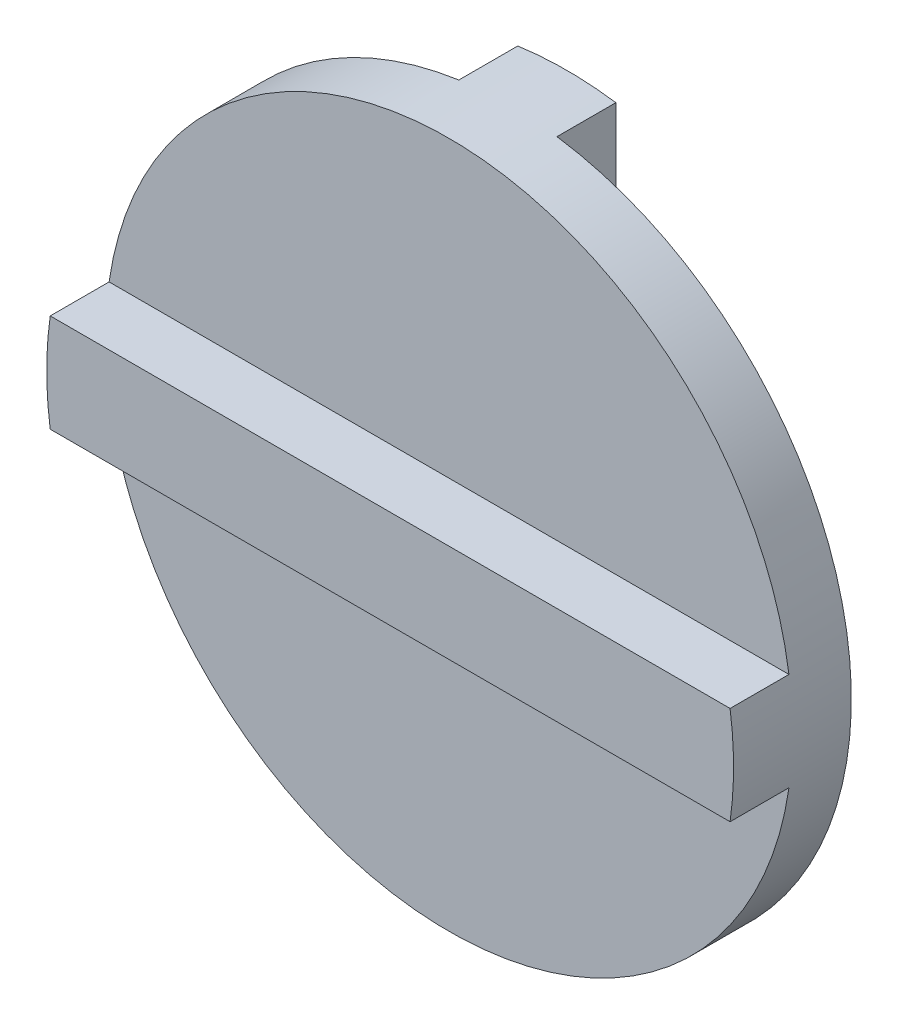
ISO-10303-21;
HEADER;
FILE_DESCRIPTION(('STEP AP214'),'2;1');
FILE_NAME('part.step','',(''),(''),'','','');
FILE_SCHEMA(('AUTOMOTIVE_DESIGN { 1 0 10303 214 1 1 1 1 }'));
ENDSEC;
DATA;
#1=APPLICATION_CONTEXT('core data for automotive mechanical design processes');
#2=APPLICATION_PROTOCOL_DEFINITION('international standard','automotive_design',2000,#1);
#3=PRODUCT_CONTEXT('',#1,'mechanical');
#4=PRODUCT('Part','Part','',(#3));
#5=PRODUCT_RELATED_PRODUCT_CATEGORY('part','',(#4));
#6=PRODUCT_DEFINITION_FORMATION('','',#4);
#7=PRODUCT_DEFINITION_CONTEXT('part definition',#1,'design');
#8=PRODUCT_DEFINITION('design','',#6,#7);
#9=PRODUCT_DEFINITION_SHAPE('','',#8);
#10=(LENGTH_UNIT() NAMED_UNIT(*) SI_UNIT(.MILLI.,.METRE.));
#11=(NAMED_UNIT(*) PLANE_ANGLE_UNIT() SI_UNIT($,.RADIAN.));
#12=(NAMED_UNIT(*) SI_UNIT($,.STERADIAN.) SOLID_ANGLE_UNIT());
#13=UNCERTAINTY_MEASURE_WITH_UNIT(LENGTH_MEASURE(1.E-05),#10,'distance_accuracy_value','');
#14=(GEOMETRIC_REPRESENTATION_CONTEXT(3) GLOBAL_UNCERTAINTY_ASSIGNED_CONTEXT((#13)) GLOBAL_UNIT_ASSIGNED_CONTEXT((#10,
#11,#12)) REPRESENTATION_CONTEXT('',''));
#15=CARTESIAN_POINT('',(0.,0.,0.));
#16=DIRECTION('',(0.,0.,1.));
#17=DIRECTION('',(1.,0.,0.));
#18=AXIS2_PLACEMENT_3D('',#15,#16,#17);
#19=CARTESIAN_POINT('',(0.,0.,0.));
#20=DIRECTION('',(0.,0.,1.));
#21=DIRECTION('',(1.,0.,0.));
#22=AXIS2_PLACEMENT_3D('',#19,#20,#21);
#23=PLANE('',#22);
#24=DIRECTION('',(0.,-1.,0.));
#25=VECTOR('',#24,1.);
#26=CARTESIAN_POINT('',(2.49999999999999,0.,0.));
#27=LINE('',#26,#25);
#28=CARTESIAN_POINT('',(2.49999999999999,17.3205080756888,0.));
#29=VERTEX_POINT('',#28);
#30=CARTESIAN_POINT('',(2.49999999999999,-17.3205080756888,0.));
#31=VERTEX_POINT('',#30);
#32=EDGE_CURVE('E116',#29,#31,#27,.T.);
#33=ORIENTED_EDGE('',*,*,#32,.F.);
#34=CARTESIAN_POINT('',(0.,0.,0.));
#35=DIRECTION('',(0.,0.,1.));
#36=DIRECTION('',(1.,0.,0.));
#37=AXIS2_PLACEMENT_3D('',#34,#35,#36);
#38=CIRCLE('',#37,17.5);
#39=EDGE_CURVE('E43',#31,#29,#38,.T.);
#40=ORIENTED_EDGE('',*,*,#39,.F.);
#41=EDGE_LOOP('',(#33,#40));
#42=FACE_BOUND('',#41,.T.);
#43=ADVANCED_FACE('F39',(#42),#23,.F.);
#44=CARTESIAN_POINT('',(0.,0.,3.));
#45=DIRECTION('',(0.,0.,1.));
#46=DIRECTION('',(1.,0.,0.));
#47=AXIS2_PLACEMENT_3D('',#44,#45,#46);
#48=PLANE('',#47);
#49=CARTESIAN_POINT('',(0.,0.,3.));
#50=DIRECTION('',(0.,0.,1.));
#51=DIRECTION('',(1.,0.,0.));
#52=AXIS2_PLACEMENT_3D('',#49,#50,#51);
#53=CIRCLE('',#52,17.5);
#54=CARTESIAN_POINT('',(17.3205080756888,2.5,3.));
#55=VERTEX_POINT('',#54);
#56=CARTESIAN_POINT('',(-17.3205080756888,2.5,3.));
#57=VERTEX_POINT('',#56);
#58=EDGE_CURVE('E11',#55,#57,#53,.T.);
#59=ORIENTED_EDGE('',*,*,#58,.T.);
#60=DIRECTION('',(1.,0.,0.));
#61=VECTOR('',#60,1.);
#62=CARTESIAN_POINT('',(0.,2.5,3.));
#63=LINE('',#62,#61);
#64=EDGE_CURVE('E124',#57,#55,#63,.T.);
#65=ORIENTED_EDGE('',*,*,#64,.T.);
#66=EDGE_LOOP('',(#59,#65));
#67=FACE_BOUND('',#66,.T.);
#68=ADVANCED_FACE('F203',(#67),#48,.T.);
#69=CARTESIAN_POINT('',(0.,0.,3.));
#70=DIRECTION('',(0.,0.,-1.));
#71=DIRECTION('',(-1.,0.,0.));
#72=AXIS2_PLACEMENT_3D('',#69,#70,#71);
#73=CYLINDRICAL_SURFACE('',#72,17.5);
#74=ORIENTED_EDGE('',*,*,#58,.F.);
#75=DIRECTION('',(0.,0.,-1.));
#76=VECTOR('',#75,1.);
#77=CARTESIAN_POINT('',(17.3205080756888,2.5,6.));
#78=LINE('',#77,#76);
#79=CARTESIAN_POINT('',(17.3205080756888,2.5,6.));
#80=VERTEX_POINT('',#79);
#81=EDGE_CURVE('E161',#80,#55,#78,.T.);
#82=ORIENTED_EDGE('',*,*,#81,.F.);
#83=CARTESIAN_POINT('',(0.,0.,6.));
#84=DIRECTION('',(0.,0.,1.));
#85=DIRECTION('',(1.,0.,0.));
#86=AXIS2_PLACEMENT_3D('',#83,#84,#85);
#87=CIRCLE('',#86,17.5);
#88=CARTESIAN_POINT('',(17.3205080756888,-2.5,6.));
#89=VERTEX_POINT('',#88);
#90=EDGE_CURVE('E158',#89,#80,#87,.T.);
#91=ORIENTED_EDGE('',*,*,#90,.F.);
#92=DIRECTION('',(0.,0.,-1.));
#93=VECTOR('',#92,1.);
#94=CARTESIAN_POINT('',(17.3205080756888,-2.5,6.));
#95=LINE('',#94,#93);
#96=CARTESIAN_POINT('',(17.3205080756888,-2.5,3.));
#97=VERTEX_POINT('',#96);
#98=EDGE_CURVE('E169',#89,#97,#95,.T.);
#99=ORIENTED_EDGE('',*,*,#98,.T.);
#100=CARTESIAN_POINT('',(-17.3205080756888,-2.5,3.));
#101=VERTEX_POINT('',#100);
#102=EDGE_CURVE('E49',#101,#97,#53,.T.);
#103=ORIENTED_EDGE('',*,*,#102,.F.);
#104=DIRECTION('',(0.,0.,-1.));
#105=VECTOR('',#104,1.);
#106=CARTESIAN_POINT('',(-17.3205080756888,-2.5,6.));
#107=LINE('',#106,#105);
#108=CARTESIAN_POINT('',(-17.3205080756888,-2.5,6.));
#109=VERTEX_POINT('',#108);
#110=EDGE_CURVE('E173',#109,#101,#107,.T.);
#111=ORIENTED_EDGE('',*,*,#110,.F.);
#112=CARTESIAN_POINT('',(0.,0.,6.));
#113=DIRECTION('',(0.,0.,1.));
#114=DIRECTION('',(1.,0.,0.));
#115=AXIS2_PLACEMENT_3D('',#112,#113,#114);
#116=CIRCLE('',#115,17.5);
#117=CARTESIAN_POINT('',(-17.3205080756888,2.5,6.));
#118=VERTEX_POINT('',#117);
#119=EDGE_CURVE('E152',#118,#109,#116,.T.);
#120=ORIENTED_EDGE('',*,*,#119,.F.);
#121=DIRECTION('',(0.,0.,-1.));
#122=VECTOR('',#121,1.);
#123=CARTESIAN_POINT('',(-17.3205080756888,2.5,6.));
#124=LINE('',#123,#122);
#125=EDGE_CURVE('E177',#118,#57,#124,.T.);
#126=ORIENTED_EDGE('',*,*,#125,.T.);
#127=EDGE_LOOP('',(#74,#82,#91,#99,#103,#111,#120,#126));
#128=FACE_BOUND('',#127,.T.);
#129=ORIENTED_EDGE('',*,*,#39,.T.);
#130=DIRECTION('',(0.,0.,1.));
#131=VECTOR('',#130,1.);
#132=CARTESIAN_POINT('',(2.49999999999999,17.3205080756888,-3.));
#133=LINE('',#132,#131);
#134=CARTESIAN_POINT('',(2.49999999999999,17.3205080756888,-3.));
#135=VERTEX_POINT('',#134);
#136=EDGE_CURVE('E143',#135,#29,#133,.T.);
#137=ORIENTED_EDGE('',*,*,#136,.F.);
#138=CARTESIAN_POINT('',(0.,0.,-3.));
#139=DIRECTION('',(0.,0.,-1.));
#140=DIRECTION('',(-1.,0.,0.));
#141=AXIS2_PLACEMENT_3D('',#138,#139,#140);
#142=CIRCLE('',#141,17.5);
#143=CARTESIAN_POINT('',(-2.5,17.3205080756888,-3.));
#144=VERTEX_POINT('',#143);
#145=EDGE_CURVE('E118',#144,#135,#142,.T.);
#146=ORIENTED_EDGE('',*,*,#145,.F.);
#147=DIRECTION('',(0.,0.,1.));
#148=VECTOR('',#147,1.);
#149=CARTESIAN_POINT('',(-2.5,17.3205080756888,-3.));
#150=LINE('',#149,#148);
#151=CARTESIAN_POINT('',(-2.5,17.3205080756888,0.));
#152=VERTEX_POINT('',#151);
#153=EDGE_CURVE('E125',#144,#152,#150,.T.);
#154=ORIENTED_EDGE('',*,*,#153,.T.);
#155=CARTESIAN_POINT('',(-2.5,-17.3205080756888,0.));
#156=VERTEX_POINT('',#155);
#157=EDGE_CURVE('E122',#152,#156,#38,.T.);
#158=ORIENTED_EDGE('',*,*,#157,.T.);
#159=DIRECTION('',(0.,0.,1.));
#160=VECTOR('',#159,1.);
#161=CARTESIAN_POINT('',(-2.5,-17.3205080756888,-3.));
#162=LINE('',#161,#160);
#163=CARTESIAN_POINT('',(-2.5,-17.3205080756888,-3.));
#164=VERTEX_POINT('',#163);
#165=EDGE_CURVE('E56',#164,#156,#162,.T.);
#166=ORIENTED_EDGE('',*,*,#165,.F.);
#167=CARTESIAN_POINT('',(2.49999999999999,-17.3205080756888,-3.));
#168=VERTEX_POINT('',#167);
#169=EDGE_CURVE('E107',#168,#164,#142,.T.);
#170=ORIENTED_EDGE('',*,*,#169,.F.);
#171=DIRECTION('',(0.,0.,1.));
#172=VECTOR('',#171,1.);
#173=CARTESIAN_POINT('',(2.49999999999999,-17.3205080756888,-3.));
#174=LINE('',#173,#172);
#175=EDGE_CURVE('E135',#168,#31,#174,.T.);
#176=ORIENTED_EDGE('',*,*,#175,.T.);
#177=EDGE_LOOP('',(#129,#137,#146,#154,#158,#166,#170,#176));
#178=FACE_BOUND('',#177,.T.);
#179=ADVANCED_FACE('F41',(#128,#178),#73,.T.);
#180=DIRECTION('',(1.,0.,0.));
#181=VECTOR('',#180,1.);
#182=CARTESIAN_POINT('',(0.,-2.5,3.));
#183=LINE('',#182,#181);
#184=EDGE_CURVE('E63',#101,#97,#183,.T.);
#185=ORIENTED_EDGE('',*,*,#184,.F.);
#186=ORIENTED_EDGE('',*,*,#102,.T.);
#187=EDGE_LOOP('',(#185,#186));
#188=FACE_BOUND('',#187,.T.);
#189=ADVANCED_FACE('F189',(#188),#48,.T.);
#190=ORIENTED_EDGE('',*,*,#157,.F.);
#191=DIRECTION('',(0.,-1.,0.));
#192=VECTOR('',#191,1.);
#193=CARTESIAN_POINT('',(-2.5,0.,0.));
#194=LINE('',#193,#192);
#195=EDGE_CURVE('E136',#152,#156,#194,.T.);
#196=ORIENTED_EDGE('',*,*,#195,.T.);
#197=EDGE_LOOP('',(#190,#196));
#198=FACE_BOUND('',#197,.T.);
#199=ADVANCED_FACE('F211',(#198),#23,.F.);
#200=CARTESIAN_POINT('',(0.,2.5,6.));
#201=DIRECTION('',(0.,1.,0.));
#202=DIRECTION('',(-1.,0.,0.));
#203=AXIS2_PLACEMENT_3D('',#200,#201,#202);
#204=PLANE('',#203);
#205=ORIENTED_EDGE('',*,*,#64,.F.);
#206=ORIENTED_EDGE('',*,*,#125,.F.);
#207=DIRECTION('',(1.,0.,0.));
#208=VECTOR('',#207,1.);
#209=CARTESIAN_POINT('',(0.,2.5,6.));
#210=LINE('',#209,#208);
#211=EDGE_CURVE('E148',#118,#80,#210,.T.);
#212=ORIENTED_EDGE('',*,*,#211,.T.);
#213=ORIENTED_EDGE('',*,*,#81,.T.);
#214=EDGE_LOOP('',(#205,#206,#212,#213));
#215=FACE_BOUND('',#214,.T.);
#216=ADVANCED_FACE('F201',(#215),#204,.T.);
#217=CARTESIAN_POINT('',(0.,-2.5,6.));
#218=DIRECTION('',(0.,1.,0.));
#219=DIRECTION('',(-1.,0.,0.));
#220=AXIS2_PLACEMENT_3D('',#217,#218,#219);
#221=PLANE('',#220);
#222=ORIENTED_EDGE('',*,*,#184,.T.);
#223=ORIENTED_EDGE('',*,*,#98,.F.);
#224=DIRECTION('',(1.,0.,0.));
#225=VECTOR('',#224,1.);
#226=CARTESIAN_POINT('',(0.,-2.5,6.));
#227=LINE('',#226,#225);
#228=EDGE_CURVE('E155',#109,#89,#227,.T.);
#229=ORIENTED_EDGE('',*,*,#228,.F.);
#230=ORIENTED_EDGE('',*,*,#110,.T.);
#231=EDGE_LOOP('',(#222,#223,#229,#230));
#232=FACE_BOUND('',#231,.T.);
#233=ADVANCED_FACE('F193',(#232),#221,.F.);
#234=CARTESIAN_POINT('',(0.,0.,6.));
#235=DIRECTION('',(0.,0.,1.));
#236=DIRECTION('',(1.,0.,0.));
#237=AXIS2_PLACEMENT_3D('',#234,#235,#236);
#238=PLANE('',#237);
#239=ORIENTED_EDGE('',*,*,#211,.F.);
#240=ORIENTED_EDGE('',*,*,#119,.T.);
#241=ORIENTED_EDGE('',*,*,#228,.T.);
#242=ORIENTED_EDGE('',*,*,#90,.T.);
#243=EDGE_LOOP('',(#239,#240,#241,#242));
#244=FACE_BOUND('',#243,.T.);
#245=ADVANCED_FACE('F199',(#244),#238,.T.);
#246=CARTESIAN_POINT('',(-2.5,0.,-3.));
#247=DIRECTION('',(-1.,0.,0.));
#248=DIRECTION('',(0.,-1.,0.));
#249=AXIS2_PLACEMENT_3D('',#246,#247,#248);
#250=PLANE('',#249);
#251=ORIENTED_EDGE('',*,*,#195,.F.);
#252=ORIENTED_EDGE('',*,*,#153,.F.);
#253=DIRECTION('',(0.,-1.,0.));
#254=VECTOR('',#253,1.);
#255=CARTESIAN_POINT('',(-2.5,0.,-3.));
#256=LINE('',#255,#254);
#257=EDGE_CURVE('E109',#144,#164,#256,.T.);
#258=ORIENTED_EDGE('',*,*,#257,.T.);
#259=ORIENTED_EDGE('',*,*,#165,.T.);
#260=EDGE_LOOP('',(#251,#252,#258,#259));
#261=FACE_BOUND('',#260,.T.);
#262=ADVANCED_FACE('F127',(#261),#250,.T.);
#263=CARTESIAN_POINT('',(2.49999999999999,0.,-3.));
#264=DIRECTION('',(-1.,0.,0.));
#265=DIRECTION('',(0.,-1.,0.));
#266=AXIS2_PLACEMENT_3D('',#263,#264,#265);
#267=PLANE('',#266);
#268=ORIENTED_EDGE('',*,*,#32,.T.);
#269=ORIENTED_EDGE('',*,*,#175,.F.);
#270=DIRECTION('',(0.,-1.,0.));
#271=VECTOR('',#270,1.);
#272=CARTESIAN_POINT('',(2.49999999999999,0.,-3.));
#273=LINE('',#272,#271);
#274=EDGE_CURVE('E111',#135,#168,#273,.T.);
#275=ORIENTED_EDGE('',*,*,#274,.F.);
#276=ORIENTED_EDGE('',*,*,#136,.T.);
#277=EDGE_LOOP('',(#268,#269,#275,#276));
#278=FACE_BOUND('',#277,.T.);
#279=ADVANCED_FACE('F230',(#278),#267,.F.);
#280=CARTESIAN_POINT('',(0.,0.,-3.));
#281=DIRECTION('',(0.,0.,-1.));
#282=DIRECTION('',(-1.,0.,0.));
#283=AXIS2_PLACEMENT_3D('',#280,#281,#282);
#284=PLANE('',#283);
#285=ORIENTED_EDGE('',*,*,#169,.T.);
#286=ORIENTED_EDGE('',*,*,#257,.F.);
#287=ORIENTED_EDGE('',*,*,#145,.T.);
#288=ORIENTED_EDGE('',*,*,#274,.T.);
#289=EDGE_LOOP('',(#285,#286,#287,#288));
#290=FACE_BOUND('',#289,.T.);
#291=ADVANCED_FACE('F108',(#290),#284,.T.);
#292=CLOSED_SHELL('',(#43,#68,#179,#189,#199,#216,#233,#245,#262,#279,#291));
#293=MANIFOLD_SOLID_BREP('B2',#292);
#294=ADVANCED_BREP_SHAPE_REPRESENTATION('',(#18,#293),#14);
#295=SHAPE_DEFINITION_REPRESENTATION(#9,#294);
ENDSEC;
END-ISO-10303-21;
